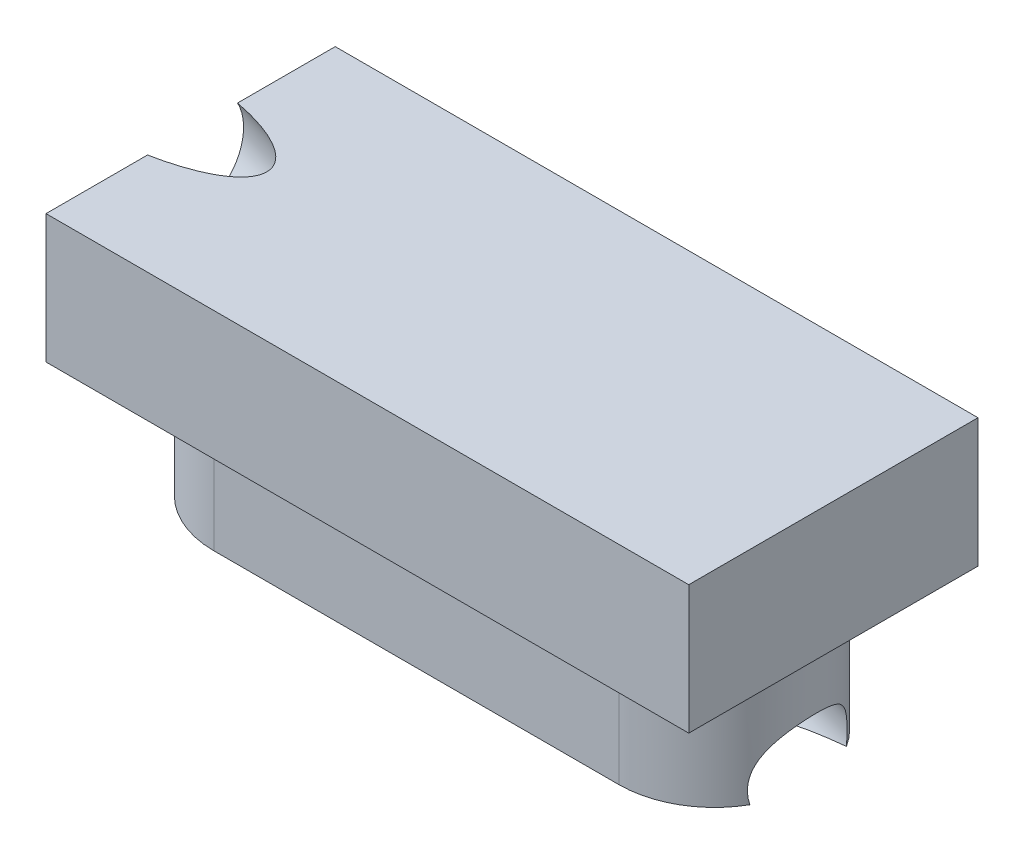
ISO-10303-21;
HEADER;
FILE_DESCRIPTION(('STEP AP214'),'2;1');
FILE_NAME('part.step','',(''),(''),'','','');
FILE_SCHEMA(('AUTOMOTIVE_DESIGN { 1 0 10303 214 1 1 1 1 }'));
ENDSEC;
DATA;
#1=APPLICATION_CONTEXT('core data for automotive mechanical design processes');
#2=APPLICATION_PROTOCOL_DEFINITION('international standard','automotive_design',2000,#1);
#3=PRODUCT_CONTEXT('',#1,'mechanical');
#4=PRODUCT('Part','Part','',(#3));
#5=PRODUCT_RELATED_PRODUCT_CATEGORY('part','',(#4));
#6=PRODUCT_DEFINITION_FORMATION('','',#4);
#7=PRODUCT_DEFINITION_CONTEXT('part definition',#1,'design');
#8=PRODUCT_DEFINITION('design','',#6,#7);
#9=PRODUCT_DEFINITION_SHAPE('','',#8);
#10=(LENGTH_UNIT() NAMED_UNIT(*) SI_UNIT(.MILLI.,.METRE.));
#11=(NAMED_UNIT(*) PLANE_ANGLE_UNIT() SI_UNIT($,.RADIAN.));
#12=(NAMED_UNIT(*) SI_UNIT($,.STERADIAN.) SOLID_ANGLE_UNIT());
#13=UNCERTAINTY_MEASURE_WITH_UNIT(LENGTH_MEASURE(1.E-05),#10,'distance_accuracy_value','');
#14=(GEOMETRIC_REPRESENTATION_CONTEXT(3) GLOBAL_UNCERTAINTY_ASSIGNED_CONTEXT((#13)) GLOBAL_UNIT_ASSIGNED_CONTEXT((#10,
#11,#12)) REPRESENTATION_CONTEXT('',''));
#15=CARTESIAN_POINT('',(0.,0.,0.));
#16=DIRECTION('',(0.,0.,1.));
#17=DIRECTION('',(1.,0.,0.));
#18=AXIS2_PLACEMENT_3D('',#15,#16,#17);
#19=CARTESIAN_POINT('',(1.575,1.,0.0473674614201627));
#20=DIRECTION('',(0.,-1.,0.));
#21=DIRECTION('',(0.,0.,-1.));
#22=AXIS2_PLACEMENT_3D('',#19,#20,#21);
#23=CYLINDRICAL_SURFACE('',#22,0.74375);
#24=CARTESIAN_POINT('',(1.575,0.,0.0473674614201627));
#25=DIRECTION('',(0.,1.,0.));
#26=DIRECTION('',(0.,0.,1.));
#27=AXIS2_PLACEMENT_3D('',#24,#25,#26);
#28=CIRCLE('',#27,0.74375);
#29=CARTESIAN_POINT('',(2.22007799454693,0.,0.417554499890329));
#30=VERTEX_POINT('',#29);
#31=CARTESIAN_POINT('',(1.575,0.,0.791117461420163));
#32=VERTEX_POINT('',#31);
#33=EDGE_CURVE('E162',#30,#32,#28,.F.);
#34=ORIENTED_EDGE('',*,*,#33,.F.);
#35=CARTESIAN_POINT('',(2.22007799454694,0.,0.417554499890312));
#36=CARTESIAN_POINT('',(2.21752980068988,0.0186655359409167,0.421959587924825));
#37=CARTESIAN_POINT('',(2.2156278539128,0.0377529154588887,0.425200077047658));
#38=CARTESIAN_POINT('',(2.21335747791011,0.0761734934447604,0.429043037917487));
#39=CARTESIAN_POINT('',(2.21298124321226,0.0955049318708844,0.42965893776736));
#40=CARTESIAN_POINT('',(2.21394142874241,0.132811954786078,0.428047133785444));
#41=CARTESIAN_POINT('',(2.21517212874171,0.150796671707374,0.42599499675304));
#42=CARTESIAN_POINT('',(2.21913119913898,0.186081787630471,0.419220579900182));
#43=CARTESIAN_POINT('',(2.22185893672031,0.203382472470854,0.414499428280477));
#44=CARTESIAN_POINT('',(2.22846855087995,0.236358377854159,0.402596030838282));
#45=CARTESIAN_POINT('',(2.23231918805684,0.252063818147794,0.395479686272524));
#46=CARTESIAN_POINT('',(2.24080251922695,0.281974923033718,0.378964878974161));
#47=CARTESIAN_POINT('',(2.24543494139474,0.296181106134427,0.369567208958603));
#48=CARTESIAN_POINT('',(2.25508892074533,0.323024411609134,0.348659136398313));
#49=CARTESIAN_POINT('',(2.26011384992911,0.33564477191656,0.337128909803348));
#50=CARTESIAN_POINT('',(2.27008829161083,0.359058790100825,0.312311609458208));
#51=CARTESIAN_POINT('',(2.27503775469288,0.369851294197828,0.299023435410751));
#52=CARTESIAN_POINT('',(2.28526165093874,0.39116716215874,0.268699272791299));
#53=CARTESIAN_POINT('',(2.29045814875562,0.401361665170207,0.251405175776769));
#54=CARTESIAN_POINT('',(2.29978636023605,0.419185736157966,0.215286739542864));
#55=CARTESIAN_POINT('',(2.30391822752806,0.42681567425487,0.196462621625039));
#56=CARTESIAN_POINT('',(2.31078029090564,0.439495789205733,0.157722682035937));
#57=CARTESIAN_POINT('',(2.31351054956899,0.444546081233358,0.137806909147837));
#58=CARTESIAN_POINT('',(2.31734753168952,0.45205061200199,0.0973402395537065));
#59=CARTESIAN_POINT('',(2.31845426294436,0.454504863211542,0.0767893458985902));
#60=CARTESIAN_POINT('',(2.31894189303544,0.456810824891715,0.0355218443674816));
#61=CARTESIAN_POINT('',(2.31832279681978,0.456662542824037,0.0148052369667759));
#62=CARTESIAN_POINT('',(2.31537755403749,0.453770834339579,-0.0263224617059372));
#63=CARTESIAN_POINT('',(2.31305143115702,0.451027443931577,-0.0467335572131242));
#64=CARTESIAN_POINT('',(2.30683052208611,0.442964108286275,-0.0867929786510007));
#65=CARTESIAN_POINT('',(2.30293575470808,0.437644193948518,-0.106441313726213));
#66=CARTESIAN_POINT('',(2.29383193581397,0.424448138250503,-0.144539686792777));
#67=CARTESIAN_POINT('',(2.28862284738761,0.41657192509953,-0.16298969111292));
#68=CARTESIAN_POINT('',(2.27718281204139,0.398149996722271,-0.198510680200681));
#69=CARTESIAN_POINT('',(2.27093898053845,0.387569570330706,-0.21555960287536));
#70=CARTESIAN_POINT('',(2.25800242786037,0.363814899630434,-0.247537745010683));
#71=CARTESIAN_POINT('',(2.2513100574656,0.350642666994046,-0.262468593078506));
#72=CARTESIAN_POINT('',(2.23793684908456,0.321314461290142,-0.290155865393597));
#73=CARTESIAN_POINT('',(2.23126204551189,0.305082641062726,-0.302836130314721));
#74=CARTESIAN_POINT('',(2.22005562831281,0.273180957051351,-0.323007143922612));
#75=CARTESIAN_POINT('',(2.21535299394936,0.257899094786939,-0.331016078673241));
#76=CARTESIAN_POINT('',(2.20716831608901,0.225955634311268,-0.344538402108485));
#77=CARTESIAN_POINT('',(2.20368605662091,0.209294280876065,-0.350052232405057));
#78=CARTESIAN_POINT('',(2.19833865917958,0.175379717667576,-0.358388014443932));
#79=CARTESIAN_POINT('',(2.19644659995251,0.158141723639402,-0.361254864156241));
#80=CARTESIAN_POINT('',(2.19427896496814,0.123307349358035,-0.364532194374534));
#81=CARTESIAN_POINT('',(2.19400656691792,0.105710332507735,-0.364937846145514));
#82=CARTESIAN_POINT('',(2.19489572202661,0.0732134675315263,-0.363599591495326));
#83=CARTESIAN_POINT('',(2.19585526488428,0.0582921782499282,-0.362158564071395));
#84=CARTESIAN_POINT('',(2.19870582336381,0.0288329180754531,-0.357799073359009));
#85=CARTESIAN_POINT('',(2.20059203453998,0.0142933732607773,-0.35488822841017));
#86=CARTESIAN_POINT('',(2.20286379371366,1.44849410244063E-12,-0.351319281572325));
#87=B_SPLINE_CURVE_WITH_KNOTS('',3,(#35,#36,#37,#38,#39,#40,#41,#42,#43,#44,#45,#46,#47,#48,#49,
#50,#51,#52,#53,#54,#55,#56,#57,#58,#59,#60,#61,#62,#63,#64,#65,#66,#67,#68,#69,#70,#71,#72,#73,
#74,#75,#76,#77,#78,#79,#80,#81,#82,#83,#84,#85,#86),.UNSPECIFIED.,.F.,.F.,(4,2,2,2,2,2,2,2,2,2,
2,2,2,2,2,2,2,2,2,2,2,2,2,2,2,4),(0.,0.0580799481596613,0.115862384252634,0.170028250303506,
0.224171237375971,0.276932106965734,0.329674669337194,0.382934705696836,0.436228236574588,
0.498183885180994,0.560130588442176,0.622074525722067,0.684018165489576,0.745961627659055,
0.807904230336246,0.869846090171268,0.931789689722781,0.994572259469804,1.05730629037803,
1.12187082685938,1.17527313800993,1.22866599371183,1.28113560759574,1.33370813077501,
1.3786648335849,1.42339087325265),.UNSPECIFIED.);
#88=CARTESIAN_POINT('',(2.20286379371756,0.,-0.351319281573164));
#89=VERTEX_POINT('',#88);
#90=EDGE_CURVE('E54',#30,#89,#87,.T.);
#91=ORIENTED_EDGE('',*,*,#90,.T.);
#92=CARTESIAN_POINT('',(1.575,0.,-0.696382538579837));
#93=VERTEX_POINT('',#92);
#94=EDGE_CURVE('E176',#93,#89,#28,.F.);
#95=ORIENTED_EDGE('',*,*,#94,.F.);
#96=DIRECTION('',(0.,-1.,0.));
#97=VECTOR('',#96,1.);
#98=CARTESIAN_POINT('',(1.575,1.,-0.696382538579837));
#99=LINE('',#98,#97);
#100=CARTESIAN_POINT('',(1.575,1.,-0.696382538579837));
#101=VERTEX_POINT('',#100);
#102=EDGE_CURVE('E48',#101,#93,#99,.T.);
#103=ORIENTED_EDGE('',*,*,#102,.F.);
#104=CARTESIAN_POINT('',(1.575,1.,0.0473674614201627));
#105=DIRECTION('',(0.,1.,0.));
#106=DIRECTION('',(0.,0.,1.));
#107=AXIS2_PLACEMENT_3D('',#104,#105,#106);
#108=CIRCLE('',#107,0.74375);
#109=CARTESIAN_POINT('',(1.575,1.,0.791117461420163));
#110=VERTEX_POINT('',#109);
#111=EDGE_CURVE('E163',#101,#110,#108,.F.);
#112=ORIENTED_EDGE('',*,*,#111,.T.);
#113=DIRECTION('',(0.,-1.,0.));
#114=VECTOR('',#113,1.);
#115=CARTESIAN_POINT('',(1.575,1.,0.791117461420163));
#116=LINE('',#115,#114);
#117=EDGE_CURVE('E175',#110,#32,#116,.T.);
#118=ORIENTED_EDGE('',*,*,#117,.T.);
#119=EDGE_LOOP('',(#34,#91,#95,#103,#112,#118));
#120=FACE_BOUND('',#119,.T.);
#121=ADVANCED_FACE('F35',(#120),#23,.T.);
#122=CARTESIAN_POINT('',(0.,0.,0.));
#123=DIRECTION('',(0.,1.,0.));
#124=DIRECTION('',(0.,0.,1.));
#125=AXIS2_PLACEMENT_3D('',#122,#123,#124);
#126=PLANE('',#125);
#127=CARTESIAN_POINT('',(2.346575,0.,0.426109121565267));
#128=CARTESIAN_POINT('',(2.31738232814973,3.50805252923313E-13,0.424775151012779));
#129=CARTESIAN_POINT('',(2.28821001523376,1.71218799975673E-13,0.423010214938611));
#130=CARTESIAN_POINT('',(2.22993446633251,-1.7121770633652E-13,0.418577574586027));
#131=CARTESIAN_POINT('',(2.2008312299072,-3.34067866595454E-13,0.415909876074005));
#132=CARTESIAN_POINT('',(2.1136668146418,8.17759590780288E-13,0.406491316130998));
#133=CARTESIAN_POINT('',(2.05575123131842,3.77283373482757E-12,0.398325003201779));
#134=CARTESIAN_POINT('',(1.94065747790816,3.70207901460915E-12,0.377587886922654));
#135=CARTESIAN_POINT('',(1.88347953637439,6.74439216482973E-13,0.365015750902503));
#136=CARTESIAN_POINT('',(1.79887676040064,-3.3729270833429E-13,0.3418653772833));
#137=CARTESIAN_POINT('',(1.77086688598763,0.,0.333432078088488));
#138=CARTESIAN_POINT('',(1.71536142347883,0.,0.314811847440452));
#139=CARTESIAN_POINT('',(1.68786715907941,0.,0.304620946812379));
#140=CARTESIAN_POINT('',(1.63018461093612,0.,0.280586550126895));
#141=CARTESIAN_POINT('',(1.60011681034727,0.,0.266439109843436));
#142=CARTESIAN_POINT('',(1.55665138715516,0.,0.242372338256161));
#143=CARTESIAN_POINT('',(1.54245864053966,-1.22771049055073E-13,0.233892828493297));
#144=CARTESIAN_POINT('',(1.51484069554354,1.2262143071892E-13,0.215774346697997));
#145=CARTESIAN_POINT('',(1.50141458284773,4.49844355984966E-13,0.206136800269898));
#146=CARTESIAN_POINT('',(1.47917548646124,3.43853709737603E-13,0.188227868105819));
#147=CARTESIAN_POINT('',(1.47009572362912,0.,0.180290199136894));
#148=CARTESIAN_POINT('',(1.45277275972483,0.,0.163509990887752));
#149=CARTESIAN_POINT('',(1.44453080363557,0.,0.15466614307726));
#150=CARTESIAN_POINT('',(1.42917113613276,0.,0.135845093401146));
#151=CARTESIAN_POINT('',(1.42206874302307,0.,0.125855121936047));
#152=CARTESIAN_POINT('',(1.40971087085563,0.,0.10481180695104));
#153=CARTESIAN_POINT('',(1.40444666119852,0.,0.0937638167236549));
#154=CARTESIAN_POINT('',(1.39766231332027,0.,0.0743056625414679));
#155=CARTESIAN_POINT('',(1.39548917009365,0.,0.0661247085573878));
#156=CARTESIAN_POINT('',(1.39255200949696,0.,0.0495137104737581));
#157=CARTESIAN_POINT('',(1.39178665315619,0.,0.0410839108192787));
#158=CARTESIAN_POINT('',(1.3917475070062,0.,0.0242076221170952));
#159=CARTESIAN_POINT('',(1.39247603300014,0.,0.0157611274663119));
#160=CARTESIAN_POINT('',(1.39534612663265,0.,-0.000887283226237519));
#161=CARTESIAN_POINT('',(1.39748889752841,0.,-0.0090889847786985));
#162=CARTESIAN_POINT('',(1.40734715556256,0.,-0.0376730370069403));
#163=CARTESIAN_POINT('',(1.41852131239809,0.,-0.0568604751621941));
#164=CARTESIAN_POINT('',(1.44284466018183,0.,-0.0886909227258694));
#165=CARTESIAN_POINT('',(1.45535359166776,0.,-0.101891703668941));
#166=CARTESIAN_POINT('',(1.48213539808946,0.,-0.126422526448996));
#167=CARTESIAN_POINT('',(1.49641261341364,0.,-0.137747799017117));
#168=CARTESIAN_POINT('',(1.52688496319349,0.,-0.159453395582025));
#169=CARTESIAN_POINT('',(1.54314309209587,0.,-0.169742596425598));
#170=CARTESIAN_POINT('',(1.57644931666035,0.,-0.188965577821587));
#171=CARTESIAN_POINT('',(1.59349811347685,0.,-0.19789812410398));
#172=CARTESIAN_POINT('',(1.64211939853497,0.,-0.221429342804836));
#173=CARTESIAN_POINT('',(1.67429538726112,0.,-0.23477376918361));
#174=CARTESIAN_POINT('',(1.73963480101334,0.,-0.258807921078273));
#175=CARTESIAN_POINT('',(1.77279947884499,0.,-0.269494102880428));
#176=CARTESIAN_POINT('',(1.83959608814373,0.,-0.28869851051127));
#177=CARTESIAN_POINT('',(1.87322551828278,0.,-0.297225524227988));
#178=CARTESIAN_POINT('',(1.94088412992049,0.,-0.31251174365698));
#179=CARTESIAN_POINT('',(1.97491340458613,-1.15983887137453E-13,-0.319270528466184));
#180=CARTESIAN_POINT('',(2.06471950159688,1.88883728563176E-13,-0.335014547614318));
#181=CARTESIAN_POINT('',(2.12072195782499,9.10820827270889E-13,-0.342729088176008));
#182=CARTESIAN_POINT('',(2.2051073309612,5.80376306199536E-13,-0.35168255005112));
#183=CARTESIAN_POINT('',(2.23336282683185,2.32304062330975E-13,-0.354233387744293));
#184=CARTESIAN_POINT('',(2.28993021008463,-2.32241226331577E-13,-0.358484842268578));
#185=CARTESIAN_POINT('',(2.31824208014608,-3.48776890999571E-13,-0.360185688889568));
#186=CARTESIAN_POINT('',(2.346575,0.,-0.361479672943026));
#187=B_SPLINE_CURVE_WITH_KNOTS('',3,(#127,#128,#129,#130,#131,#132,#133,#134,#135,#136,#137,
#138,#139,#140,#141,#142,#143,#144,#145,#146,#147,#148,#149,#150,#151,#152,#153,#154,#155,#156,
#157,#158,#159,#160,#161,#162,#163,#164,#165,#166,#167,#168,#169,#170,#171,#172,#173,#174,#175,
#176,#177,#178,#179,#180,#181,#182,#183,#184,#185,#186),.UNSPECIFIED.,.F.,.F.,(4,2,2,2,2,2,2,2,
2,2,2,2,2,2,2,2,2,2,2,2,2,2,2,2,2,2,2,2,2,4),(0.,0.0876641367226251,0.175327713501294,
0.35065577072237,0.526036906889805,0.613746483917571,0.701656792217373,0.801113904669176,
0.850672264161234,0.900170227987159,0.936303702641733,0.972490110020606,1.00912823374823,
1.04558989605249,1.07087755235072,1.09614114465587,1.12144392996356,1.14676827099575,
1.21204157683403,1.26642805415496,1.32095077612088,1.37859262642031,1.43628660851128,
1.54060218372488,1.64505608593613,1.74907776462208,1.85312418178446,2.02256733205565,
2.10766922252661,2.19274809376026),.UNSPECIFIED.);
#188=EDGE_CURVE('E124',#30,#89,#187,.T.);
#189=ORIENTED_EDGE('',*,*,#188,.F.);
#190=ORIENTED_EDGE('',*,*,#33,.T.);
#191=DIRECTION('',(1.,0.,0.));
#192=VECTOR('',#191,1.);
#193=CARTESIAN_POINT('',(0.,0.,0.791117461420163));
#194=LINE('',#193,#192);
#195=CARTESIAN_POINT('',(-1.575,0.,0.791117461420163));
#196=VERTEX_POINT('',#195);
#197=EDGE_CURVE('E166',#196,#32,#194,.T.);
#198=ORIENTED_EDGE('',*,*,#197,.F.);
#199=CARTESIAN_POINT('',(-1.575,0.,0.0473674614201627));
#200=DIRECTION('',(0.,1.,0.));
#201=DIRECTION('',(0.,0.,1.));
#202=AXIS2_PLACEMENT_3D('',#199,#200,#201);
#203=CIRCLE('',#202,0.74375);
#204=CARTESIAN_POINT('',(-1.575,0.,-0.696382538579837));
#205=VERTEX_POINT('',#204);
#206=EDGE_CURVE('E182',#196,#205,#203,.F.);
#207=ORIENTED_EDGE('',*,*,#206,.T.);
#208=DIRECTION('',(1.,0.,0.));
#209=VECTOR('',#208,1.);
#210=CARTESIAN_POINT('',(0.,0.,-0.696382538579837));
#211=LINE('',#210,#209);
#212=EDGE_CURVE('E179',#205,#93,#211,.T.);
#213=ORIENTED_EDGE('',*,*,#212,.T.);
#214=ORIENTED_EDGE('',*,*,#94,.T.);
#215=EDGE_LOOP('',(#189,#190,#198,#207,#213,#214));
#216=FACE_BOUND('',#215,.T.);
#217=ADVANCED_FACE('F201',(#216),#126,.F.);
#218=CARTESIAN_POINT('',(-2.5,2.,-1.07763253857984));
#219=DIRECTION('',(1.,0.,0.));
#220=DIRECTION('',(0.,0.,-1.));
#221=AXIS2_PLACEMENT_3D('',#218,#219,#220);
#222=PLANE('',#221);
#223=CARTESIAN_POINT('',(-2.5,2.,-0.317936772964535));
#224=CARTESIAN_POINT('',(-2.5,1.98059400012431,-0.328297893178377));
#225=CARTESIAN_POINT('',(-2.5,1.96031609395947,-0.337011695009106));
#226=CARTESIAN_POINT('',(-2.5,1.91860097923725,-0.350979581708868));
#227=CARTESIAN_POINT('',(-2.5,1.89716377067987,-0.3562336665779));
#228=CARTESIAN_POINT('',(-2.5,1.85371456135836,-0.363117039158797));
#229=CARTESIAN_POINT('',(-2.5,1.83170256059423,-0.364746326870662));
#230=CARTESIAN_POINT('',(-2.5,1.78771269830616,-0.364340570471703));
#231=CARTESIAN_POINT('',(-2.5,1.76573483678222,-0.362305526360879));
#232=CARTESIAN_POINT('',(-2.5,1.72241894710352,-0.354625787786488));
#233=CARTESIAN_POINT('',(-2.5,1.70108091894876,-0.348981093322922));
#234=CARTESIAN_POINT('',(-2.5,1.65963335779808,-0.334238130322301));
#235=CARTESIAN_POINT('',(-2.5,1.63952382480217,-0.325139861785246));
#236=CARTESIAN_POINT('',(-2.5,1.60108786736927,-0.303740589292517));
#237=CARTESIAN_POINT('',(-2.5,1.58276144293227,-0.291439585336842));
#238=CARTESIAN_POINT('',(-2.5,1.54839717962613,-0.263974148255288));
#239=CARTESIAN_POINT('',(-2.5,1.53235934075698,-0.248809715129407));
#240=CARTESIAN_POINT('',(-2.5,1.50301459146342,-0.216035667905357));
#241=CARTESIAN_POINT('',(-2.5,1.48970768103901,-0.198426053807187));
#242=CARTESIAN_POINT('',(-2.5,1.46619181196707,-0.161247343711466));
#243=CARTESIAN_POINT('',(-2.5,1.45598285331954,-0.141678247713914));
#244=CARTESIAN_POINT('',(-2.5,1.43894446456698,-0.101120315528838));
#245=CARTESIAN_POINT('',(-2.5,1.43211503446196,-0.0801314793413135));
#246=CARTESIAN_POINT('',(-2.5,1.42202406779837,-0.0373129675276175));
#247=CARTESIAN_POINT('',(-2.5,1.4187625312398,-0.015483291901446));
#248=CARTESIAN_POINT('',(-2.5,1.41589730927084,0.0284148067260627));
#249=CARTESIAN_POINT('',(-2.5,1.41629362386045,0.0504832297273999));
#250=CARTESIAN_POINT('',(-2.5,1.42073317327167,0.0942501460180027));
#251=CARTESIAN_POINT('',(-2.5,1.42477640809329,0.115948639307268));
#252=CARTESIAN_POINT('',(-2.5,1.43639828015317,0.158377222256411));
#253=CARTESIAN_POINT('',(-2.5,1.44397691739143,0.179107311916287));
#254=CARTESIAN_POINT('',(-2.5,1.46246056482905,0.219027323599381));
#255=CARTESIAN_POINT('',(-2.5,1.47336557502841,0.238217245622599));
#256=CARTESIAN_POINT('',(-2.5,1.49820119469471,0.274527637843366));
#257=CARTESIAN_POINT('',(-2.5,1.51213180416166,0.291648108040916));
#258=CARTESIAN_POINT('',(-2.5,1.54263439238862,0.32334739107827));
#259=CARTESIAN_POINT('',(-2.5,1.55920637114862,0.337926203918073));
#260=CARTESIAN_POINT('',(-2.5,1.59453463836486,0.364140067706757));
#261=CARTESIAN_POINT('',(-2.5,1.6132909268211,0.375775118655638));
#262=CARTESIAN_POINT('',(-2.5,1.65247042202832,0.395780552167141));
#263=CARTESIAN_POINT('',(-2.5,1.6728936287793,0.404150934729763));
#264=CARTESIAN_POINT('',(-2.5,1.71484391268046,0.417396149976966));
#265=CARTESIAN_POINT('',(-2.5,1.73637098983063,0.422270982661547));
#266=CARTESIAN_POINT('',(-2.5,1.77993432846075,0.428390699524808));
#267=CARTESIAN_POINT('',(-2.5,1.80197058994069,0.429635583703489));
#268=CARTESIAN_POINT('',(-2.5,1.8459480155054,0.428460859417944));
#269=CARTESIAN_POINT('',(-2.5,1.86788917959017,0.426041250953718));
#270=CARTESIAN_POINT('',(-2.5,1.90851904556333,0.418101254330287));
#271=CARTESIAN_POINT('',(-2.5,1.92728672795575,0.412979111234722));
#272=CARTESIAN_POINT('',(-2.5,1.9642847454032,0.399911928975123));
#273=CARTESIAN_POINT('',(-2.5,1.98249373508707,0.39190643066596));
#274=CARTESIAN_POINT('',(-2.5,1.99999999999999,0.382566221586777));
#275=B_SPLINE_CURVE_WITH_KNOTS('',3,(#223,#224,#225,#226,#227,#228,#229,#230,#231,#232,#233,
#234,#235,#236,#237,#238,#239,#240,#241,#242,#243,#244,#245,#246,#247,#248,#249,#250,#251,#252,
#253,#254,#255,#256,#257,#258,#259,#260,#261,#262,#263,#264,#265,#266,#267,#268,#269,#270,#271,
#272,#273,#274),.UNSPECIFIED.,.F.,.F.,(4,2,2,2,2,2,2,2,2,2,2,2,2,2,2,2,2,2,2,2,2,2,2,2,2,4),(0.,
0.0659115563194932,0.131823112638985,0.197734668958477,0.263646225277969,0.329557781597461,
0.395469337916953,0.461380894236445,0.527292450555936,0.593204006875428,0.65911556319492,
0.725027119514411,0.790938675833903,0.856850232153395,0.922761788472886,0.988673344792378,
1.05458490111187,1.12049645743136,1.18640801375085,1.25231957007034,1.31823112638984,
1.38414268270933,1.45005423902882,1.51596579534831,1.57412380409808,1.6335799862812),.UNSPECIFIED.);
#276=CARTESIAN_POINT('',(-2.5,2.,-0.317936772964535));
#277=VERTEX_POINT('',#276);
#278=CARTESIAN_POINT('',(-2.5,2.,0.382566221591575));
#279=VERTEX_POINT('',#278);
#280=EDGE_CURVE('E61',#277,#279,#275,.T.);
#281=ORIENTED_EDGE('',*,*,#280,.F.);
#282=DIRECTION('',(0.,0.,1.));
#283=VECTOR('',#282,1.);
#284=CARTESIAN_POINT('',(-2.5,2.,-1.07763253857984));
#285=LINE('',#284,#283);
#286=CARTESIAN_POINT('',(-2.5,2.,-1.07763253857984));
#287=VERTEX_POINT('',#286);
#288=EDGE_CURVE('E121',#287,#277,#285,.T.);
#289=ORIENTED_EDGE('',*,*,#288,.F.);
#290=DIRECTION('',(0.,-1.,0.));
#291=VECTOR('',#290,1.);
#292=CARTESIAN_POINT('',(-2.5,2.,-1.07763253857984));
#293=LINE('',#292,#291);
#294=CARTESIAN_POINT('',(-2.5,1.,-1.07763253857984));
#295=VERTEX_POINT('',#294);
#296=EDGE_CURVE('E143',#287,#295,#293,.T.);
#297=ORIENTED_EDGE('',*,*,#296,.T.);
#298=DIRECTION('',(0.,0.,1.));
#299=VECTOR('',#298,1.);
#300=CARTESIAN_POINT('',(-2.5,1.,-1.07763253857984));
#301=LINE('',#300,#299);
#302=CARTESIAN_POINT('',(-2.5,1.,1.17236746142016));
#303=VERTEX_POINT('',#302);
#304=EDGE_CURVE('E144',#295,#303,#301,.T.);
#305=ORIENTED_EDGE('',*,*,#304,.T.);
#306=DIRECTION('',(0.,-1.,0.));
#307=VECTOR('',#306,1.);
#308=CARTESIAN_POINT('',(-2.5,2.,1.17236746142016));
#309=LINE('',#308,#307);
#310=CARTESIAN_POINT('',(-2.5,2.,1.17236746142016));
#311=VERTEX_POINT('',#310);
#312=EDGE_CURVE('E159',#311,#303,#309,.T.);
#313=ORIENTED_EDGE('',*,*,#312,.F.);
#314=EDGE_CURVE('E123',#279,#311,#285,.T.);
#315=ORIENTED_EDGE('',*,*,#314,.F.);
#316=EDGE_LOOP('',(#281,#289,#297,#305,#313,#315));
#317=FACE_BOUND('',#316,.T.);
#318=ADVANCED_FACE('F119',(#317),#222,.F.);
#319=CARTESIAN_POINT('',(0.,2.,0.));
#320=DIRECTION('',(0.,1.,0.));
#321=DIRECTION('',(0.,0.,1.));
#322=AXIS2_PLACEMENT_3D('',#319,#320,#321);
#323=PLANE('',#322);
#324=ORIENTED_EDGE('',*,*,#288,.T.);
#325=CARTESIAN_POINT('',(-2.5,2.,-0.317936772964535));
#326=CARTESIAN_POINT('',(-2.47127729535429,2.,-0.312357588162685));
#327=CARTESIAN_POINT('',(-2.44266563125951,2.,-0.30621712707801));
#328=CARTESIAN_POINT('',(-2.38578661849369,2.,-0.292623503689121));
#329=CARTESIAN_POINT('',(-2.35751896544523,2.,-0.285171608166973));
#330=CARTESIAN_POINT('',(-2.2841892239013,2.,-0.263722336655962));
#331=CARTESIAN_POINT('',(-2.23945637582542,1.99999999999999,-0.248513080223905));
#332=CARTESIAN_POINT('',(-2.16774008633411,2.00000000000001,-0.218974357714848));
#333=CARTESIAN_POINT('',(-2.14009789735838,2.00000000000002,-0.206252733236482));
#334=CARTESIAN_POINT('',(-2.08642732548051,1.99999999999998,-0.177759668939709));
#335=CARTESIAN_POINT('',(-2.06039510753733,1.99999999999994,-0.161995876835474));
#336=CARTESIAN_POINT('',(-2.02442408501774,1.99999999999997,-0.135579621193512));
#337=CARTESIAN_POINT('',(-2.01325564908913,1.99999999999999,-0.126633511189538));
#338=CARTESIAN_POINT('',(-1.99196954524506,2.00000000000001,-0.107582070602844));
#339=CARTESIAN_POINT('',(-1.98185247501711,2.,-0.0974760874426464));
#340=CARTESIAN_POINT('',(-1.95705072751683,2.,-0.0687099256903317));
#341=CARTESIAN_POINT('',(-1.94365324928329,2.,-0.048749538622725));
#342=CARTESIAN_POINT('',(-1.93131005139871,2.,-0.0190151209528794));
#343=CARTESIAN_POINT('',(-1.92858826410927,2.,-0.0108129860102212));
#344=CARTESIAN_POINT('',(-1.92454625779649,2.,0.00593051395953294));
#345=CARTESIAN_POINT('',(-1.92322443918998,2.,0.0144714802368244));
#346=CARTESIAN_POINT('',(-1.9221220114003,2.,0.0316865913453196));
#347=CARTESIAN_POINT('',(-1.92234709612814,2.00000000000001,0.0403611108060153));
#348=CARTESIAN_POINT('',(-1.92432490768219,1.99999999999999,0.0575348316649135));
#349=CARTESIAN_POINT('',(-1.92607879497096,1.99999999999995,0.066033894862259));
#350=CARTESIAN_POINT('',(-1.9314164021547,1.99999999999994,0.0842815233120808));
#351=CARTESIAN_POINT('',(-1.9352944805615,1.99999999999998,0.0939427749181369));
#352=CARTESIAN_POINT('',(-1.94456089041985,2.00000000000002,0.112522440596315));
#353=CARTESIAN_POINT('',(-1.94995394535586,2.00000000000001,0.121438416341535));
#354=CARTESIAN_POINT('',(-1.96539798863781,1.99999999999999,0.143586733466623));
#355=CARTESIAN_POINT('',(-1.9763064249225,2.,0.156213934410769));
#356=CARTESIAN_POINT('',(-1.99982864633503,2.,0.179754216694935));
#357=CARTESIAN_POINT('',(-2.01244746471138,2.,0.190662025244814));
#358=CARTESIAN_POINT('',(-2.03917679554346,2.,0.211398983027432));
#359=CARTESIAN_POINT('',(-2.05332201283921,2.,0.221182724215826));
#360=CARTESIAN_POINT('',(-2.08237749953529,2.,0.239545602315389));
#361=CARTESIAN_POINT('',(-2.09728847357608,2.00000000000001,0.248123601581907));
#362=CARTESIAN_POINT('',(-2.14283357411209,1.99999999999999,0.272395171466601));
#363=CARTESIAN_POINT('',(-2.17425490326738,1.99999999999993,0.286608534120867));
#364=CARTESIAN_POINT('',(-2.22979486437923,2.00000000000004,0.308817190840672));
#365=CARTESIAN_POINT('',(-2.25366671972914,2.00000000000016,0.317465526420381));
#366=CARTESIAN_POINT('',(-2.30179745417342,1.99999999999984,0.333453603045437));
#367=CARTESIAN_POINT('',(-2.32605553120426,1.9999999999994,0.340795747116761));
#368=CARTESIAN_POINT('',(-2.37511488946673,2.0000000000006,0.354449226489593));
#369=CARTESIAN_POINT('',(-2.39991917321888,2.00000000000225,0.360749592896928));
#370=CARTESIAN_POINT('',(-2.44978926639505,1.99999999999775,0.372366649740822));
#371=CARTESIAN_POINT('',(-2.47485535295878,1.99999999999158,0.377682155501469));
#372=CARTESIAN_POINT('',(-2.49999999999254,1.99999999997654,0.382566221591575));
#373=B_SPLINE_CURVE_WITH_KNOTS('',3,(#325,#326,#327,#328,#329,#330,#331,#332,#333,#334,#335,
#336,#337,#338,#339,#340,#341,#342,#343,#344,#345,#346,#347,#348,#349,#350,#351,#352,#353,#354,
#355,#356,#357,#358,#359,#360,#361,#362,#363,#364,#365,#366,#367,#368,#369,#370,#371,#372),
.UNSPECIFIED.,.F.,.F.,(4,2,2,2,2,2,2,2,2,2,2,2,2,2,2,2,2,2,2,2,2,2,2,4),(0.,0.0877637889365405,
0.175443263022218,0.316880667414951,0.408059042315635,0.499011121183926,0.541858271794959,
0.584729648708066,0.655375706608949,0.681200192342079,0.706995139468823,0.732885084511163,
0.758794698869592,0.789852947163894,0.821009126508685,0.87078657718109,0.920713827015326,
0.972230911182377,1.02379628120619,1.12701819784221,1.20315999101428,1.2791602224938,
1.35591571703465,1.43276294868972),.UNSPECIFIED.);
#374=EDGE_CURVE('E11',#277,#279,#373,.T.);
#375=ORIENTED_EDGE('',*,*,#374,.T.);
#376=ORIENTED_EDGE('',*,*,#314,.T.);
#377=DIRECTION('',(1.,0.,0.));
#378=VECTOR('',#377,1.);
#379=CARTESIAN_POINT('',(-2.5,2.,1.17236746142016));
#380=LINE('',#379,#378);
#381=CARTESIAN_POINT('',(2.5,2.,1.17236746142016));
#382=VERTEX_POINT('',#381);
#383=EDGE_CURVE('E130',#311,#382,#380,.T.);
#384=ORIENTED_EDGE('',*,*,#383,.T.);
#385=DIRECTION('',(0.,0.,-1.));
#386=VECTOR('',#385,1.);
#387=CARTESIAN_POINT('',(2.5,2.,-1.07763253857984));
#388=LINE('',#387,#386);
#389=CARTESIAN_POINT('',(2.5,2.,-1.07763253857984));
#390=VERTEX_POINT('',#389);
#391=EDGE_CURVE('E132',#382,#390,#388,.T.);
#392=ORIENTED_EDGE('',*,*,#391,.T.);
#393=DIRECTION('',(-1.,0.,0.));
#394=VECTOR('',#393,1.);
#395=CARTESIAN_POINT('',(-2.5,2.,-1.07763253857984));
#396=LINE('',#395,#394);
#397=EDGE_CURVE('E128',#390,#287,#396,.T.);
#398=ORIENTED_EDGE('',*,*,#397,.T.);
#399=EDGE_LOOP('',(#324,#375,#376,#384,#392,#398));
#400=FACE_BOUND('',#399,.T.);
#401=ADVANCED_FACE('F126',(#400),#323,.T.);
#402=CARTESIAN_POINT('',(0.,1.,-0.696382538579837));
#403=DIRECTION('',(0.,0.,-1.));
#404=DIRECTION('',(-1.,0.,0.));
#405=AXIS2_PLACEMENT_3D('',#402,#403,#404);
#406=PLANE('',#405);
#407=ORIENTED_EDGE('',*,*,#212,.F.);
#408=DIRECTION('',(0.,-1.,0.));
#409=VECTOR('',#408,1.);
#410=CARTESIAN_POINT('',(-1.575,1.,-0.696382538579837));
#411=LINE('',#410,#409);
#412=CARTESIAN_POINT('',(-1.575,1.,-0.696382538579837));
#413=VERTEX_POINT('',#412);
#414=EDGE_CURVE('E191',#413,#205,#411,.T.);
#415=ORIENTED_EDGE('',*,*,#414,.F.);
#416=DIRECTION('',(1.,0.,0.));
#417=VECTOR('',#416,1.);
#418=CARTESIAN_POINT('',(0.,1.,-0.696382538579837));
#419=LINE('',#418,#417);
#420=EDGE_CURVE('E165',#413,#101,#419,.T.);
#421=ORIENTED_EDGE('',*,*,#420,.T.);
#422=ORIENTED_EDGE('',*,*,#102,.T.);
#423=EDGE_LOOP('',(#407,#415,#421,#422));
#424=FACE_BOUND('',#423,.T.);
#425=ADVANCED_FACE('F195',(#424),#406,.T.);
#426=CARTESIAN_POINT('',(-1.575,1.,0.0473674614201627));
#427=DIRECTION('',(0.,-1.,0.));
#428=DIRECTION('',(0.,0.,-1.));
#429=AXIS2_PLACEMENT_3D('',#426,#427,#428);
#430=CYLINDRICAL_SURFACE('',#429,0.74375);
#431=ORIENTED_EDGE('',*,*,#206,.F.);
#432=DIRECTION('',(0.,-1.,0.));
#433=VECTOR('',#432,1.);
#434=CARTESIAN_POINT('',(-1.575,1.,0.791117461420163));
#435=LINE('',#434,#433);
#436=CARTESIAN_POINT('',(-1.575,1.,0.791117461420163));
#437=VERTEX_POINT('',#436);
#438=EDGE_CURVE('E189',#437,#196,#435,.T.);
#439=ORIENTED_EDGE('',*,*,#438,.F.);
#440=CARTESIAN_POINT('',(-1.575,1.,0.0473674614201627));
#441=DIRECTION('',(0.,1.,0.));
#442=DIRECTION('',(0.,0.,1.));
#443=AXIS2_PLACEMENT_3D('',#440,#441,#442);
#444=CIRCLE('',#443,0.74375);
#445=EDGE_CURVE('E169',#437,#413,#444,.F.);
#446=ORIENTED_EDGE('',*,*,#445,.T.);
#447=ORIENTED_EDGE('',*,*,#414,.T.);
#448=EDGE_LOOP('',(#431,#439,#446,#447));
#449=FACE_BOUND('',#448,.T.);
#450=ADVANCED_FACE('F205',(#449),#430,.T.);
#451=CARTESIAN_POINT('',(0.,1.,0.791117461420163));
#452=DIRECTION('',(0.,0.,-1.));
#453=DIRECTION('',(-1.,0.,0.));
#454=AXIS2_PLACEMENT_3D('',#451,#452,#453);
#455=PLANE('',#454);
#456=ORIENTED_EDGE('',*,*,#197,.T.);
#457=ORIENTED_EDGE('',*,*,#117,.F.);
#458=DIRECTION('',(1.,0.,0.));
#459=VECTOR('',#458,1.);
#460=CARTESIAN_POINT('',(0.,1.,0.791117461420163));
#461=LINE('',#460,#459);
#462=EDGE_CURVE('E172',#437,#110,#461,.T.);
#463=ORIENTED_EDGE('',*,*,#462,.F.);
#464=ORIENTED_EDGE('',*,*,#438,.T.);
#465=EDGE_LOOP('',(#456,#457,#463,#464));
#466=FACE_BOUND('',#465,.T.);
#467=ADVANCED_FACE('F213',(#466),#455,.F.);
#468=CARTESIAN_POINT('',(-2.5,2.,1.17236746142016));
#469=DIRECTION('',(0.,0.,-1.));
#470=DIRECTION('',(-1.,0.,0.));
#471=AXIS2_PLACEMENT_3D('',#468,#469,#470);
#472=PLANE('',#471);
#473=DIRECTION('',(1.,0.,0.));
#474=VECTOR('',#473,1.);
#475=CARTESIAN_POINT('',(-2.5,1.,1.17236746142016));
#476=LINE('',#475,#474);
#477=CARTESIAN_POINT('',(2.5,1.,1.17236746142016));
#478=VERTEX_POINT('',#477);
#479=EDGE_CURVE('E147',#303,#478,#476,.T.);
#480=ORIENTED_EDGE('',*,*,#479,.T.);
#481=DIRECTION('',(0.,-1.,0.));
#482=VECTOR('',#481,1.);
#483=CARTESIAN_POINT('',(2.5,2.,1.17236746142016));
#484=LINE('',#483,#482);
#485=EDGE_CURVE('E156',#382,#478,#484,.T.);
#486=ORIENTED_EDGE('',*,*,#485,.F.);
#487=ORIENTED_EDGE('',*,*,#383,.F.);
#488=ORIENTED_EDGE('',*,*,#312,.T.);
#489=EDGE_LOOP('',(#480,#486,#487,#488));
#490=FACE_BOUND('',#489,.T.);
#491=ADVANCED_FACE('F215',(#490),#472,.F.);
#492=CARTESIAN_POINT('',(2.5,2.,-1.07763253857984));
#493=DIRECTION('',(-1.,0.,0.));
#494=DIRECTION('',(0.,0.,1.));
#495=AXIS2_PLACEMENT_3D('',#492,#493,#494);
#496=PLANE('',#495);
#497=DIRECTION('',(0.,0.,-1.));
#498=VECTOR('',#497,1.);
#499=CARTESIAN_POINT('',(2.5,1.,-1.07763253857984));
#500=LINE('',#499,#498);
#501=CARTESIAN_POINT('',(2.5,1.,-1.07763253857984));
#502=VERTEX_POINT('',#501);
#503=EDGE_CURVE('E149',#478,#502,#500,.T.);
#504=ORIENTED_EDGE('',*,*,#503,.T.);
#505=DIRECTION('',(0.,-1.,0.));
#506=VECTOR('',#505,1.);
#507=CARTESIAN_POINT('',(2.5,2.,-1.07763253857984));
#508=LINE('',#507,#506);
#509=EDGE_CURVE('E153',#390,#502,#508,.T.);
#510=ORIENTED_EDGE('',*,*,#509,.F.);
#511=ORIENTED_EDGE('',*,*,#391,.F.);
#512=ORIENTED_EDGE('',*,*,#485,.T.);
#513=EDGE_LOOP('',(#504,#510,#511,#512));
#514=FACE_BOUND('',#513,.T.);
#515=ADVANCED_FACE('F221',(#514),#496,.F.);
#516=CARTESIAN_POINT('',(-2.5,2.,-1.07763253857984));
#517=DIRECTION('',(0.,0.,1.));
#518=DIRECTION('',(1.,0.,0.));
#519=AXIS2_PLACEMENT_3D('',#516,#517,#518);
#520=PLANE('',#519);
#521=DIRECTION('',(-1.,0.,0.));
#522=VECTOR('',#521,1.);
#523=CARTESIAN_POINT('',(-2.5,1.,-1.07763253857984));
#524=LINE('',#523,#522);
#525=EDGE_CURVE('E134',#502,#295,#524,.T.);
#526=ORIENTED_EDGE('',*,*,#525,.T.);
#527=ORIENTED_EDGE('',*,*,#296,.F.);
#528=ORIENTED_EDGE('',*,*,#397,.F.);
#529=ORIENTED_EDGE('',*,*,#509,.T.);
#530=EDGE_LOOP('',(#526,#527,#528,#529));
#531=FACE_BOUND('',#530,.T.);
#532=ADVANCED_FACE('F254',(#531),#520,.F.);
#533=CARTESIAN_POINT('',(0.,1.,0.));
#534=DIRECTION('',(0.,1.,0.));
#535=DIRECTION('',(0.,0.,1.));
#536=AXIS2_PLACEMENT_3D('',#533,#534,#535);
#537=PLANE('',#536);
#538=ORIENTED_EDGE('',*,*,#111,.F.);
#539=ORIENTED_EDGE('',*,*,#420,.F.);
#540=ORIENTED_EDGE('',*,*,#445,.F.);
#541=ORIENTED_EDGE('',*,*,#462,.T.);
#542=EDGE_LOOP('',(#538,#539,#540,#541));
#543=FACE_BOUND('',#542,.T.);
#544=ORIENTED_EDGE('',*,*,#304,.F.);
#545=ORIENTED_EDGE('',*,*,#525,.F.);
#546=ORIENTED_EDGE('',*,*,#503,.F.);
#547=ORIENTED_EDGE('',*,*,#479,.F.);
#548=EDGE_LOOP('',(#544,#545,#546,#547));
#549=FACE_BOUND('',#548,.T.);
#550=ADVANCED_FACE('F209',(#543,#549),#537,.F.);
#551=CARTESIAN_POINT('',(-2.86763170788278,1.94716923663604,0.0323147243111206));
#552=DIRECTION('',(-1.,0.,0.));
#553=DIRECTION('',(0.,0.,1.));
#554=AXIS2_PLACEMENT_3D('',#551,#552,#553);
#555=CIRCLE('',#554,0.396875);
#556=DIRECTION('',(0.93969262078591,-0.342020143325663,0.));
#557=VECTOR('',#556,1.);
#558=SURFACE_OF_LINEAR_EXTRUSION('',#555,#557);
#559=ORIENTED_EDGE('',*,*,#188,.T.);
#560=ORIENTED_EDGE('',*,*,#90,.F.);
#561=EDGE_LOOP('',(#559,#560));
#562=FACE_BOUND('',#561,.T.);
#563=ORIENTED_EDGE('',*,*,#280,.T.);
#564=ORIENTED_EDGE('',*,*,#374,.F.);
#565=EDGE_LOOP('',(#563,#564));
#566=FACE_BOUND('',#565,.T.);
#567=ADVANCED_FACE('F113',(#562,#566),#558,.T.);
#568=CLOSED_SHELL('',(#121,#217,#318,#401,#425,#450,#467,#491,#515,#532,#550,#567));
#569=MANIFOLD_SOLID_BREP('B2',#568);
#570=ADVANCED_BREP_SHAPE_REPRESENTATION('',(#18,#569),#14);
#571=SHAPE_DEFINITION_REPRESENTATION(#9,#570);
ENDSEC;
END-ISO-10303-21;
